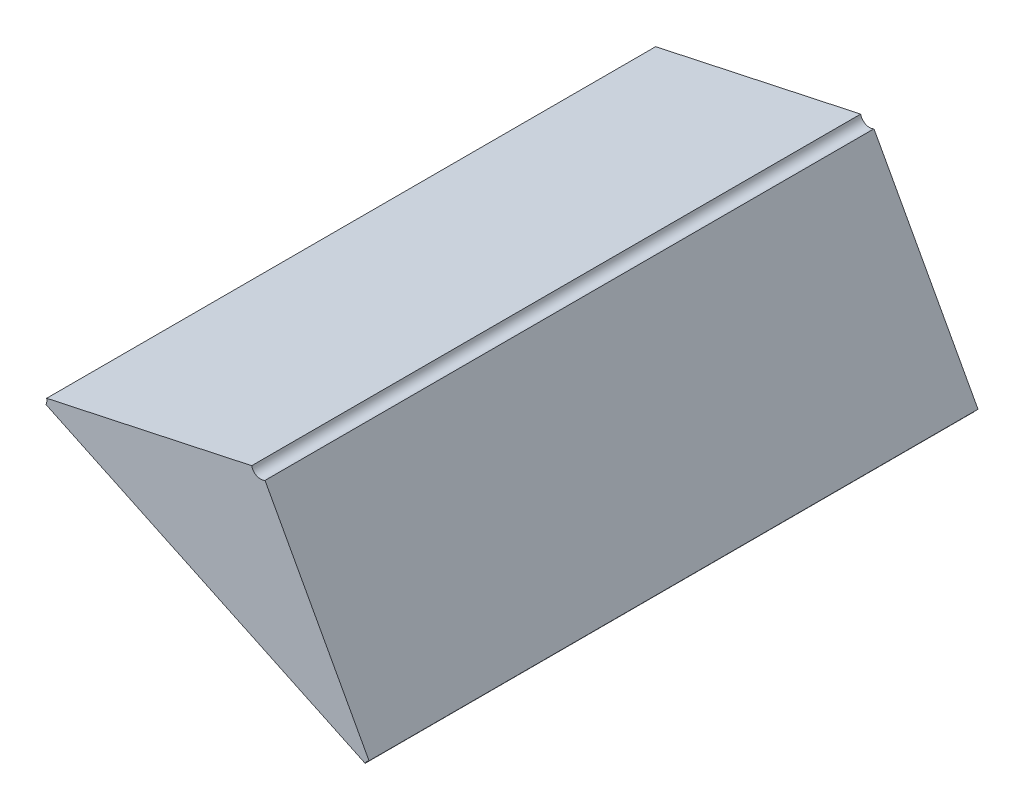
ISO-10303-21;
HEADER;
FILE_DESCRIPTION(('STEP AP214'),'2;1');
FILE_NAME('part.step','',(''),(''),'','','');
FILE_SCHEMA(('AUTOMOTIVE_DESIGN { 1 0 10303 214 1 1 1 1 }'));
ENDSEC;
DATA;
#1=APPLICATION_CONTEXT('core data for automotive mechanical design processes');
#2=APPLICATION_PROTOCOL_DEFINITION('international standard','automotive_design',2000,#1);
#3=PRODUCT_CONTEXT('',#1,'mechanical');
#4=PRODUCT('Part','Part','',(#3));
#5=PRODUCT_RELATED_PRODUCT_CATEGORY('part','',(#4));
#6=PRODUCT_DEFINITION_FORMATION('','',#4);
#7=PRODUCT_DEFINITION_CONTEXT('part definition',#1,'design');
#8=PRODUCT_DEFINITION('design','',#6,#7);
#9=PRODUCT_DEFINITION_SHAPE('','',#8);
#10=(LENGTH_UNIT() NAMED_UNIT(*) SI_UNIT(.MILLI.,.METRE.));
#11=(NAMED_UNIT(*) PLANE_ANGLE_UNIT() SI_UNIT($,.RADIAN.));
#12=(NAMED_UNIT(*) SI_UNIT($,.STERADIAN.) SOLID_ANGLE_UNIT());
#13=UNCERTAINTY_MEASURE_WITH_UNIT(LENGTH_MEASURE(1.E-05),#10,'distance_accuracy_value','');
#14=(GEOMETRIC_REPRESENTATION_CONTEXT(3) GLOBAL_UNCERTAINTY_ASSIGNED_CONTEXT((#13)) GLOBAL_UNIT_ASSIGNED_CONTEXT((#10,
#11,#12)) REPRESENTATION_CONTEXT('',''));
#15=CARTESIAN_POINT('',(0.,0.,0.));
#16=DIRECTION('',(0.,0.,1.));
#17=DIRECTION('',(1.,0.,0.));
#18=AXIS2_PLACEMENT_3D('',#15,#16,#17);
#19=CARTESIAN_POINT('',(-0.780082888944771,-0.812887620911013,0.1));
#20=DIRECTION('',(0.,0.,1.));
#21=DIRECTION('',(-1.,0.,0.));
#22=AXIS2_PLACEMENT_3D('',#19,#20,#21);
#23=CYLINDRICAL_SURFACE('',#22,0.0015);
#24=DIRECTION('',(0.,0.,-1.));
#25=VECTOR('',#24,1.);
#26=CARTESIAN_POINT('',(-0.780800771536944,-0.811570561844815,0.1));
#27=LINE('',#26,#25);
#28=CARTESIAN_POINT('',(-0.780800771536944,-0.811570561844815,0.1));
#29=VERTEX_POINT('',#28);
#30=CARTESIAN_POINT('',(-0.780800771536944,-0.811570561844815,0.));
#31=VERTEX_POINT('',#30);
#32=EDGE_CURVE('E11',#29,#31,#27,.T.);
#33=ORIENTED_EDGE('',*,*,#32,.F.);
#34=CARTESIAN_POINT('',(-0.780082888944771,-0.812887620911013,0.1));
#35=DIRECTION('',(0.,0.,-1.));
#36=DIRECTION('',(-0.903806397975616,0.427941578931451,0.));
#37=AXIS2_PLACEMENT_3D('',#34,#35,#36);
#38=CIRCLE('',#37,0.0015);
#39=CARTESIAN_POINT('',(-0.781438598541734,-0.812245708542616,0.1));
#40=VERTEX_POINT('',#39);
#41=EDGE_CURVE('E92',#40,#29,#38,.T.);
#42=ORIENTED_EDGE('',*,*,#41,.F.);
#43=DIRECTION('',(0.,0.,1.));
#44=VECTOR('',#43,1.);
#45=CARTESIAN_POINT('',(-0.781438598541734,-0.812245708542616,0.));
#46=LINE('',#45,#44);
#47=CARTESIAN_POINT('',(-0.781438598541734,-0.812245708542616,0.));
#48=VERTEX_POINT('',#47);
#49=EDGE_CURVE('E97',#48,#40,#46,.T.);
#50=ORIENTED_EDGE('',*,*,#49,.F.);
#51=CARTESIAN_POINT('',(-0.780082888944771,-0.812887620911013,0.));
#52=DIRECTION('',(0.,0.,1.));
#53=DIRECTION('',(-0.478588394782124,0.878039377465424,0.));
#54=AXIS2_PLACEMENT_3D('',#51,#52,#53);
#55=CIRCLE('',#54,0.0015);
#56=EDGE_CURVE('E113',#31,#48,#55,.T.);
#57=ORIENTED_EDGE('',*,*,#56,.F.);
#58=EDGE_LOOP('',(#33,#42,#50,#57));
#59=FACE_BOUND('',#58,.T.);
#60=ADVANCED_FACE('F17',(#59),#23,.F.);
#61=CARTESIAN_POINT('',(-0.798601549558721,-0.778912469373211,0.1));
#62=DIRECTION('',(0.,0.,1.));
#63=DIRECTION('',(-1.,0.,0.));
#64=AXIS2_PLACEMENT_3D('',#61,#62,#63);
#65=CYLINDRICAL_SURFACE('',#64,0.0015);
#66=DIRECTION('',(0.,0.,1.));
#67=VECTOR('',#66,1.);
#68=CARTESIAN_POINT('',(-0.797883666966547,-0.780229528439409,0.));
#69=LINE('',#68,#67);
#70=CARTESIAN_POINT('',(-0.797883666966547,-0.780229528439409,0.));
#71=VERTEX_POINT('',#70);
#72=CARTESIAN_POINT('',(-0.797883666966547,-0.780229528439409,0.1));
#73=VERTEX_POINT('',#72);
#74=EDGE_CURVE('E24',#71,#73,#69,.T.);
#75=ORIENTED_EDGE('',*,*,#74,.F.);
#76=CARTESIAN_POINT('',(-0.798601549558721,-0.778912469373211,0.));
#77=DIRECTION('',(0.,0.,1.));
#78=DIRECTION('',(-0.977619939969163,-0.210378832049926,0.));
#79=AXIS2_PLACEMENT_3D('',#76,#77,#78);
#80=CIRCLE('',#79,0.0015);
#81=CARTESIAN_POINT('',(-0.800067979468675,-0.779228037621286,0.));
#82=VERTEX_POINT('',#81);
#83=EDGE_CURVE('E93',#82,#71,#80,.T.);
#84=ORIENTED_EDGE('',*,*,#83,.F.);
#85=DIRECTION('',(0.,0.,-1.));
#86=VECTOR('',#85,1.);
#87=CARTESIAN_POINT('',(-0.800067979468675,-0.779228037621286,0.1));
#88=LINE('',#87,#86);
#89=CARTESIAN_POINT('',(-0.800067979468675,-0.779228037621286,0.1));
#90=VERTEX_POINT('',#89);
#91=EDGE_CURVE('E111',#90,#82,#88,.T.);
#92=ORIENTED_EDGE('',*,*,#91,.F.);
#93=CARTESIAN_POINT('',(-0.798601549558721,-0.778912469373211,0.1));
#94=DIRECTION('',(0.,0.,-1.));
#95=DIRECTION('',(0.478588394782591,-0.87803937746517,0.));
#96=AXIS2_PLACEMENT_3D('',#93,#94,#95);
#97=CIRCLE('',#96,0.0015);
#98=EDGE_CURVE('E84',#73,#90,#97,.T.);
#99=ORIENTED_EDGE('',*,*,#98,.F.);
#100=EDGE_LOOP('',(#75,#84,#92,#99));
#101=FACE_BOUND('',#100,.T.);
#102=ADVANCED_FACE('F110',(#101),#65,.F.);
#103=CARTESIAN_POINT('',(-0.835202983834856,-0.786788911617844,0.1));
#104=DIRECTION('',(0.,0.,1.));
#105=DIRECTION('',(-1.,0.,0.));
#106=AXIS2_PLACEMENT_3D('',#103,#104,#105);
#107=CYLINDRICAL_SURFACE('',#106,0.0015);
#108=DIRECTION('',(0.,0.,1.));
#109=VECTOR('',#108,1.);
#110=CARTESIAN_POINT('',(-0.833736553924902,-0.786473343369769,0.));
#111=LINE('',#110,#109);
#112=CARTESIAN_POINT('',(-0.833736553924902,-0.786473343369769,0.));
#113=VERTEX_POINT('',#112);
#114=CARTESIAN_POINT('',(-0.833736553924902,-0.786473343369769,0.1));
#115=VERTEX_POINT('',#114);
#116=EDGE_CURVE('E70',#113,#115,#111,.T.);
#117=ORIENTED_EDGE('',*,*,#116,.F.);
#118=CARTESIAN_POINT('',(-0.835202983834856,-0.786788911617844,0.));
#119=DIRECTION('',(0.,0.,1.));
#120=DIRECTION('',(0.903806397976012,-0.427941578930614,0.));
#121=AXIS2_PLACEMENT_3D('',#118,#119,#120);
#122=CIRCLE('',#121,0.0015);
#123=CARTESIAN_POINT('',(-0.833847274237892,-0.78743082398624,0.));
#124=VERTEX_POINT('',#123);
#125=EDGE_CURVE('E112',#124,#113,#122,.T.);
#126=ORIENTED_EDGE('',*,*,#125,.F.);
#127=DIRECTION('',(0.,0.,-1.));
#128=VECTOR('',#127,1.);
#129=CARTESIAN_POINT('',(-0.833847274237892,-0.78743082398624,0.1));
#130=LINE('',#129,#128);
#131=CARTESIAN_POINT('',(-0.833847274237892,-0.78743082398624,0.1));
#132=VERTEX_POINT('',#131);
#133=EDGE_CURVE('E73',#132,#124,#130,.T.);
#134=ORIENTED_EDGE('',*,*,#133,.F.);
#135=CARTESIAN_POINT('',(-0.835202983834856,-0.786788911617844,0.1));
#136=DIRECTION('',(0.,0.,-1.));
#137=DIRECTION('',(0.977619939969163,0.210378832049926,0.));
#138=AXIS2_PLACEMENT_3D('',#135,#136,#137);
#139=CIRCLE('',#138,0.0015);
#140=EDGE_CURVE('E66',#115,#132,#139,.T.);
#141=ORIENTED_EDGE('',*,*,#140,.F.);
#142=EDGE_LOOP('',(#117,#126,#134,#141));
#143=FACE_BOUND('',#142,.T.);
#144=ADVANCED_FACE('F68',(#143),#107,.F.);
#145=CARTESIAN_POINT('',(-0.805006776392714,-0.794088640671192,0.1));
#146=DIRECTION('',(0.,0.,1.));
#147=DIRECTION('',(1.,0.,0.));
#148=AXIS2_PLACEMENT_3D('',#145,#146,#147);
#149=PLANE('',#148);
#150=ORIENTED_EDGE('',*,*,#41,.T.);
#151=DIRECTION('',(-0.478588394782365,0.878039377465293,0.));
#152=VECTOR('',#151,1.);
#153=CARTESIAN_POINT('',(-0.780800771536944,-0.811570561844815,0.1));
#154=LINE('',#153,#152);
#155=EDGE_CURVE('E103',#29,#73,#154,.T.);
#156=ORIENTED_EDGE('',*,*,#155,.T.);
#157=ORIENTED_EDGE('',*,*,#98,.T.);
#158=DIRECTION('',(-0.977619939969144,-0.210378832050011,0.));
#159=VECTOR('',#158,1.);
#160=CARTESIAN_POINT('',(-0.800067979468675,-0.779228037621286,0.1));
#161=LINE('',#160,#159);
#162=EDGE_CURVE('E82',#90,#115,#161,.T.);
#163=ORIENTED_EDGE('',*,*,#162,.T.);
#164=ORIENTED_EDGE('',*,*,#140,.T.);
#165=DIRECTION('',(0.903806397975917,-0.427941578930815,0.));
#166=VECTOR('',#165,1.);
#167=CARTESIAN_POINT('',(-0.833847274237892,-0.78743082398624,0.1));
#168=LINE('',#167,#166);
#169=EDGE_CURVE('E77',#132,#40,#168,.T.);
#170=ORIENTED_EDGE('',*,*,#169,.T.);
#171=EDGE_LOOP('',(#150,#156,#157,#163,#164,#170));
#172=FACE_BOUND('',#171,.T.);
#173=ADVANCED_FACE('F83',(#172),#149,.T.);
#174=CARTESIAN_POINT('',(-0.835202983834856,-0.786788911617844,0.));
#175=DIRECTION('',(-0.427941578930812,-0.903806397975918,0.));
#176=DIRECTION('',(0.903806397975918,-0.427941578930812,0.));
#177=AXIS2_PLACEMENT_3D('',#174,#175,#176);
#178=PLANE('',#177);
#179=ORIENTED_EDGE('',*,*,#49,.T.);
#180=ORIENTED_EDGE('',*,*,#169,.F.);
#181=ORIENTED_EDGE('',*,*,#133,.T.);
#182=DIRECTION('',(0.903806397975917,-0.427941578930815,0.));
#183=VECTOR('',#182,1.);
#184=CARTESIAN_POINT('',(-0.833847274237892,-0.78743082398624,0.));
#185=LINE('',#184,#183);
#186=EDGE_CURVE('E107',#124,#48,#185,.T.);
#187=ORIENTED_EDGE('',*,*,#186,.T.);
#188=EDGE_LOOP('',(#179,#180,#181,#187));
#189=FACE_BOUND('',#188,.T.);
#190=ADVANCED_FACE('F121',(#189),#178,.T.);
#191=CARTESIAN_POINT('',(-0.798601549558721,-0.778912469373211,0.));
#192=DIRECTION('',(-0.210378832050012,0.977619939969144,0.));
#193=DIRECTION('',(-0.977619939969144,-0.210378832050012,0.));
#194=AXIS2_PLACEMENT_3D('',#191,#192,#193);
#195=PLANE('',#194);
#196=ORIENTED_EDGE('',*,*,#91,.T.);
#197=DIRECTION('',(-0.977619939969144,-0.210378832050011,0.));
#198=VECTOR('',#197,1.);
#199=CARTESIAN_POINT('',(-0.800067979468675,-0.779228037621286,0.));
#200=LINE('',#199,#198);
#201=EDGE_CURVE('E78',#82,#113,#200,.T.);
#202=ORIENTED_EDGE('',*,*,#201,.T.);
#203=ORIENTED_EDGE('',*,*,#116,.T.);
#204=ORIENTED_EDGE('',*,*,#162,.F.);
#205=EDGE_LOOP('',(#196,#202,#203,#204));
#206=FACE_BOUND('',#205,.T.);
#207=ADVANCED_FACE('F89',(#206),#195,.T.);
#208=CARTESIAN_POINT('',(-0.780082888944771,-0.812887620911013,0.));
#209=DIRECTION('',(0.878039377465292,0.478588394782367,0.));
#210=DIRECTION('',(-0.478588394782367,0.878039377465292,0.));
#211=AXIS2_PLACEMENT_3D('',#208,#209,#210);
#212=PLANE('',#211);
#213=ORIENTED_EDGE('',*,*,#32,.T.);
#214=DIRECTION('',(-0.478588394782365,0.878039377465293,0.));
#215=VECTOR('',#214,1.);
#216=CARTESIAN_POINT('',(-0.780800771536944,-0.811570561844815,0.));
#217=LINE('',#216,#215);
#218=EDGE_CURVE('E87',#31,#71,#217,.T.);
#219=ORIENTED_EDGE('',*,*,#218,.T.);
#220=ORIENTED_EDGE('',*,*,#74,.T.);
#221=ORIENTED_EDGE('',*,*,#155,.F.);
#222=EDGE_LOOP('',(#213,#219,#220,#221));
#223=FACE_BOUND('',#222,.T.);
#224=ADVANCED_FACE('F102',(#223),#212,.T.);
#225=CARTESIAN_POINT('',(-0.805006776392714,-0.794088640671192,0.));
#226=DIRECTION('',(0.,0.,1.));
#227=DIRECTION('',(1.,0.,0.));
#228=AXIS2_PLACEMENT_3D('',#225,#226,#227);
#229=PLANE('',#228);
#230=ORIENTED_EDGE('',*,*,#56,.T.);
#231=ORIENTED_EDGE('',*,*,#186,.F.);
#232=ORIENTED_EDGE('',*,*,#125,.T.);
#233=ORIENTED_EDGE('',*,*,#201,.F.);
#234=ORIENTED_EDGE('',*,*,#83,.T.);
#235=ORIENTED_EDGE('',*,*,#218,.F.);
#236=EDGE_LOOP('',(#230,#231,#232,#233,#234,#235));
#237=FACE_BOUND('',#236,.T.);
#238=ADVANCED_FACE('F109',(#237),#229,.F.);
#239=CLOSED_SHELL('',(#60,#102,#144,#173,#190,#207,#224,#238));
#240=MANIFOLD_SOLID_BREP('B1',#239);
#241=ADVANCED_BREP_SHAPE_REPRESENTATION('',(#18,#240),#14);
#242=SHAPE_DEFINITION_REPRESENTATION(#9,#241);
ENDSEC;
END-ISO-10303-21;
